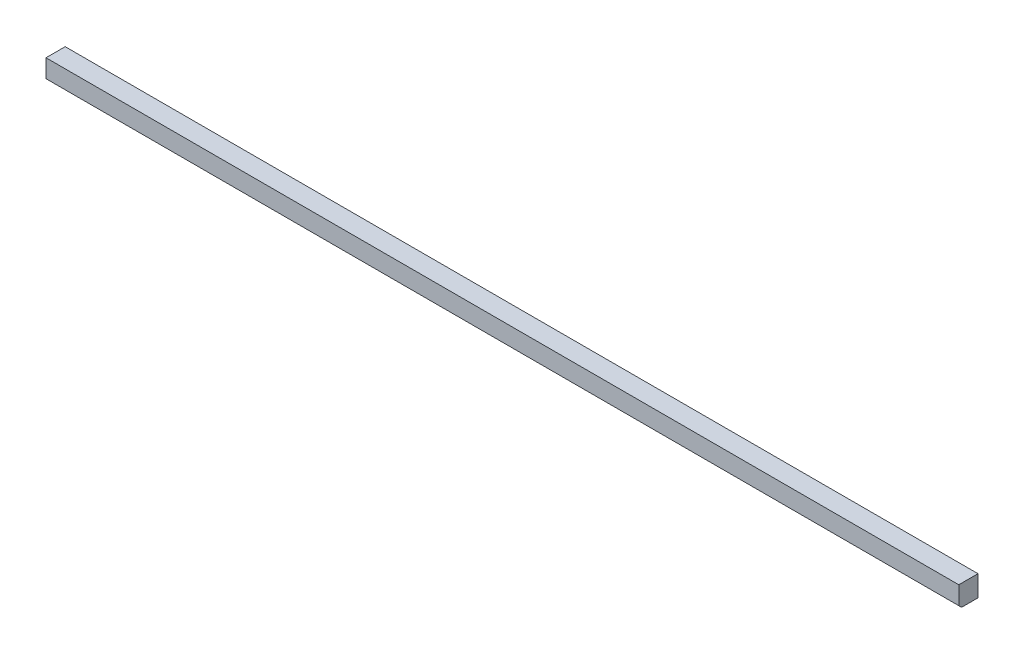
ISO-10303-21;
HEADER;
FILE_DESCRIPTION(('STEP AP214'),'2;1');
FILE_NAME('part.step','',(''),(''),'','','');
FILE_SCHEMA(('AUTOMOTIVE_DESIGN { 1 0 10303 214 1 1 1 1 }'));
ENDSEC;
DATA;
#1=APPLICATION_CONTEXT('core data for automotive mechanical design processes');
#2=APPLICATION_PROTOCOL_DEFINITION('international standard','automotive_design',2000,#1);
#3=PRODUCT_CONTEXT('',#1,'mechanical');
#4=PRODUCT('Part','Part','',(#3));
#5=PRODUCT_RELATED_PRODUCT_CATEGORY('part','',(#4));
#6=PRODUCT_DEFINITION_FORMATION('','',#4);
#7=PRODUCT_DEFINITION_CONTEXT('part definition',#1,'design');
#8=PRODUCT_DEFINITION('design','',#6,#7);
#9=PRODUCT_DEFINITION_SHAPE('','',#8);
#10=(LENGTH_UNIT() NAMED_UNIT(*) SI_UNIT(.MILLI.,.METRE.));
#11=(NAMED_UNIT(*) PLANE_ANGLE_UNIT() SI_UNIT($,.RADIAN.));
#12=(NAMED_UNIT(*) SI_UNIT($,.STERADIAN.) SOLID_ANGLE_UNIT());
#13=UNCERTAINTY_MEASURE_WITH_UNIT(LENGTH_MEASURE(1.E-05),#10,'distance_accuracy_value','');
#14=(GEOMETRIC_REPRESENTATION_CONTEXT(3) GLOBAL_UNCERTAINTY_ASSIGNED_CONTEXT((#13)) GLOBAL_UNIT_ASSIGNED_CONTEXT((#10,
#11,#12)) REPRESENTATION_CONTEXT('',''));
#15=CARTESIAN_POINT('',(0.,0.,0.));
#16=DIRECTION('',(0.,0.,1.));
#17=DIRECTION('',(1.,0.,0.));
#18=AXIS2_PLACEMENT_3D('',#15,#16,#17);
#19=CARTESIAN_POINT('',(0.,19.05,0.));
#20=DIRECTION('',(1.,0.,0.));
#21=DIRECTION('',(0.,0.,-1.));
#22=AXIS2_PLACEMENT_3D('',#19,#20,#21);
#23=PLANE('',#22);
#24=DIRECTION('',(0.,0.,1.));
#25=VECTOR('',#24,1.);
#26=CARTESIAN_POINT('',(0.,0.,0.));
#27=LINE('',#26,#25);
#28=CARTESIAN_POINT('',(0.,0.,-17.4625));
#29=VERTEX_POINT('',#28);
#30=CARTESIAN_POINT('',(0.,0.,-2.53999999999999));
#31=VERTEX_POINT('',#30);
#32=EDGE_CURVE('E124',#29,#31,#27,.T.);
#33=ORIENTED_EDGE('',*,*,#32,.T.);
#34=DIRECTION('',(0.,0.707106781186532,0.707106781186563));
#35=VECTOR('',#34,1.);
#36=CARTESIAN_POINT('',(0.,2.53999999999988,0.));
#37=LINE('',#36,#35);
#38=CARTESIAN_POINT('',(0.,2.53999999999988,0.));
#39=VERTEX_POINT('',#38);
#40=EDGE_CURVE('E11',#31,#39,#37,.T.);
#41=ORIENTED_EDGE('',*,*,#40,.T.);
#42=DIRECTION('',(0.,-1.,0.));
#43=VECTOR('',#42,1.);
#44=CARTESIAN_POINT('',(0.,19.05,0.));
#45=LINE('',#44,#43);
#46=CARTESIAN_POINT('',(0.,19.05,0.));
#47=VERTEX_POINT('',#46);
#48=EDGE_CURVE('E92',#47,#39,#45,.T.);
#49=ORIENTED_EDGE('',*,*,#48,.F.);
#50=DIRECTION('',(0.,0.,1.));
#51=VECTOR('',#50,1.);
#52=CARTESIAN_POINT('',(0.,19.05,0.));
#53=LINE('',#52,#51);
#54=CARTESIAN_POINT('',(0.,19.05,-17.4625));
#55=VERTEX_POINT('',#54);
#56=EDGE_CURVE('E98',#55,#47,#53,.T.);
#57=ORIENTED_EDGE('',*,*,#56,.F.);
#58=DIRECTION('',(0.,-1.,0.));
#59=VECTOR('',#58,1.);
#60=CARTESIAN_POINT('',(0.,19.05,-17.4625));
#61=LINE('',#60,#59);
#62=EDGE_CURVE('E119',#55,#29,#61,.T.);
#63=ORIENTED_EDGE('',*,*,#62,.T.);
#64=EDGE_LOOP('',(#33,#41,#49,#57,#63));
#65=FACE_BOUND('',#64,.T.);
#66=ADVANCED_FACE('F40',(#65),#23,.F.);
#67=CARTESIAN_POINT('',(0.,19.05,0.));
#68=DIRECTION('',(0.,0.,-1.));
#69=DIRECTION('',(-1.,0.,0.));
#70=AXIS2_PLACEMENT_3D('',#67,#68,#69);
#71=PLANE('',#70);
#72=ORIENTED_EDGE('',*,*,#48,.T.);
#73=DIRECTION('',(1.,0.,0.));
#74=VECTOR('',#73,1.);
#75=CARTESIAN_POINT('',(830.2752,2.53999999999988,0.));
#76=LINE('',#75,#74);
#77=CARTESIAN_POINT('',(830.2752,2.53999999999988,0.));
#78=VERTEX_POINT('',#77);
#79=EDGE_CURVE('E110',#39,#78,#76,.T.);
#80=ORIENTED_EDGE('',*,*,#79,.T.);
#81=DIRECTION('',(0.,-1.,0.));
#82=VECTOR('',#81,1.);
#83=CARTESIAN_POINT('',(830.2752,19.05,0.));
#84=LINE('',#83,#82);
#85=CARTESIAN_POINT('',(830.2752,19.05,0.));
#86=VERTEX_POINT('',#85);
#87=EDGE_CURVE('E94',#86,#78,#84,.T.);
#88=ORIENTED_EDGE('',*,*,#87,.F.);
#89=DIRECTION('',(1.,0.,0.));
#90=VECTOR('',#89,1.);
#91=CARTESIAN_POINT('',(0.,19.05,0.));
#92=LINE('',#91,#90);
#93=EDGE_CURVE('E87',#47,#86,#92,.T.);
#94=ORIENTED_EDGE('',*,*,#93,.F.);
#95=EDGE_LOOP('',(#72,#80,#88,#94));
#96=FACE_BOUND('',#95,.T.);
#97=ADVANCED_FACE('F89',(#96),#71,.F.);
#98=CARTESIAN_POINT('',(830.2752,19.05,0.));
#99=DIRECTION('',(-1.,0.,0.));
#100=DIRECTION('',(0.,0.,1.));
#101=AXIS2_PLACEMENT_3D('',#98,#99,#100);
#102=PLANE('',#101);
#103=ORIENTED_EDGE('',*,*,#87,.T.);
#104=DIRECTION('',(0.,-0.707106781186532,-0.707106781186563));
#105=VECTOR('',#104,1.);
#106=CARTESIAN_POINT('',(830.2752,2.53999999999988,0.));
#107=LINE('',#106,#105);
#108=CARTESIAN_POINT('',(830.2752,0.,-2.53999999999999));
#109=VERTEX_POINT('',#108);
#110=EDGE_CURVE('E63',#78,#109,#107,.T.);
#111=ORIENTED_EDGE('',*,*,#110,.T.);
#112=DIRECTION('',(0.,0.,-1.));
#113=VECTOR('',#112,1.);
#114=CARTESIAN_POINT('',(830.2752,0.,0.));
#115=LINE('',#114,#113);
#116=CARTESIAN_POINT('',(830.2752,0.,-17.4625));
#117=VERTEX_POINT('',#116);
#118=EDGE_CURVE('E122',#109,#117,#115,.T.);
#119=ORIENTED_EDGE('',*,*,#118,.T.);
#120=DIRECTION('',(0.,-1.,0.));
#121=VECTOR('',#120,1.);
#122=CARTESIAN_POINT('',(830.2752,19.05,-17.4625));
#123=LINE('',#122,#121);
#124=CARTESIAN_POINT('',(830.2752,19.05,-17.4625));
#125=VERTEX_POINT('',#124);
#126=EDGE_CURVE('E113',#125,#117,#123,.T.);
#127=ORIENTED_EDGE('',*,*,#126,.F.);
#128=DIRECTION('',(0.,0.,-1.));
#129=VECTOR('',#128,1.);
#130=CARTESIAN_POINT('',(830.2752,19.05,0.));
#131=LINE('',#130,#129);
#132=EDGE_CURVE('E97',#86,#125,#131,.T.);
#133=ORIENTED_EDGE('',*,*,#132,.F.);
#134=EDGE_LOOP('',(#103,#111,#119,#127,#133));
#135=FACE_BOUND('',#134,.T.);
#136=ADVANCED_FACE('F128',(#135),#102,.F.);
#137=CARTESIAN_POINT('',(0.,19.05,-17.4625));
#138=DIRECTION('',(0.,0.,1.));
#139=DIRECTION('',(1.,0.,0.));
#140=AXIS2_PLACEMENT_3D('',#137,#138,#139);
#141=PLANE('',#140);
#142=DIRECTION('',(-1.,0.,0.));
#143=VECTOR('',#142,1.);
#144=CARTESIAN_POINT('',(0.,0.,-17.4625));
#145=LINE('',#144,#143);
#146=EDGE_CURVE('E107',#117,#29,#145,.T.);
#147=ORIENTED_EDGE('',*,*,#146,.T.);
#148=ORIENTED_EDGE('',*,*,#62,.F.);
#149=DIRECTION('',(-1.,0.,0.));
#150=VECTOR('',#149,1.);
#151=CARTESIAN_POINT('',(0.,19.05,-17.4625));
#152=LINE('',#151,#150);
#153=EDGE_CURVE('E103',#125,#55,#152,.T.);
#154=ORIENTED_EDGE('',*,*,#153,.F.);
#155=ORIENTED_EDGE('',*,*,#126,.T.);
#156=EDGE_LOOP('',(#147,#148,#154,#155));
#157=FACE_BOUND('',#156,.T.);
#158=ADVANCED_FACE('F131',(#157),#141,.F.);
#159=CARTESIAN_POINT('',(0.,19.05,0.));
#160=DIRECTION('',(0.,-1.,0.));
#161=DIRECTION('',(0.,0.,-1.));
#162=AXIS2_PLACEMENT_3D('',#159,#160,#161);
#163=PLANE('',#162);
#164=ORIENTED_EDGE('',*,*,#56,.T.);
#165=ORIENTED_EDGE('',*,*,#93,.T.);
#166=ORIENTED_EDGE('',*,*,#132,.T.);
#167=ORIENTED_EDGE('',*,*,#153,.T.);
#168=EDGE_LOOP('',(#164,#165,#166,#167));
#169=FACE_BOUND('',#168,.T.);
#170=ADVANCED_FACE('F101',(#169),#163,.F.);
#171=CARTESIAN_POINT('',(0.,0.,0.));
#172=DIRECTION('',(0.,-1.,0.));
#173=DIRECTION('',(0.,0.,-1.));
#174=AXIS2_PLACEMENT_3D('',#171,#172,#173);
#175=PLANE('',#174);
#176=ORIENTED_EDGE('',*,*,#118,.F.);
#177=DIRECTION('',(-1.,0.,0.));
#178=VECTOR('',#177,1.);
#179=CARTESIAN_POINT('',(0.,0.,-2.53999999999999));
#180=LINE('',#179,#178);
#181=EDGE_CURVE('E49',#109,#31,#180,.T.);
#182=ORIENTED_EDGE('',*,*,#181,.T.);
#183=ORIENTED_EDGE('',*,*,#32,.F.);
#184=ORIENTED_EDGE('',*,*,#146,.F.);
#185=EDGE_LOOP('',(#176,#182,#183,#184));
#186=FACE_BOUND('',#185,.T.);
#187=ADVANCED_FACE('F132',(#186),#175,.T.);
#188=CARTESIAN_POINT('',(0.,2.53999999999988,0.));
#189=DIRECTION('',(0.,-0.707106781186563,0.707106781186532));
#190=DIRECTION('',(-1.,0.,0.));
#191=AXIS2_PLACEMENT_3D('',#188,#189,#190);
#192=PLANE('',#191);
#193=ORIENTED_EDGE('',*,*,#40,.F.);
#194=ORIENTED_EDGE('',*,*,#181,.F.);
#195=ORIENTED_EDGE('',*,*,#110,.F.);
#196=ORIENTED_EDGE('',*,*,#79,.F.);
#197=EDGE_LOOP('',(#193,#194,#195,#196));
#198=FACE_BOUND('',#197,.T.);
#199=ADVANCED_FACE('F43',(#198),#192,.T.);
#200=CLOSED_SHELL('',(#66,#97,#136,#158,#170,#187,#199));
#201=MANIFOLD_SOLID_BREP('B2',#200);
#202=ADVANCED_BREP_SHAPE_REPRESENTATION('',(#18,#201),#14);
#203=SHAPE_DEFINITION_REPRESENTATION(#9,#202);
ENDSEC;
END-ISO-10303-21;
